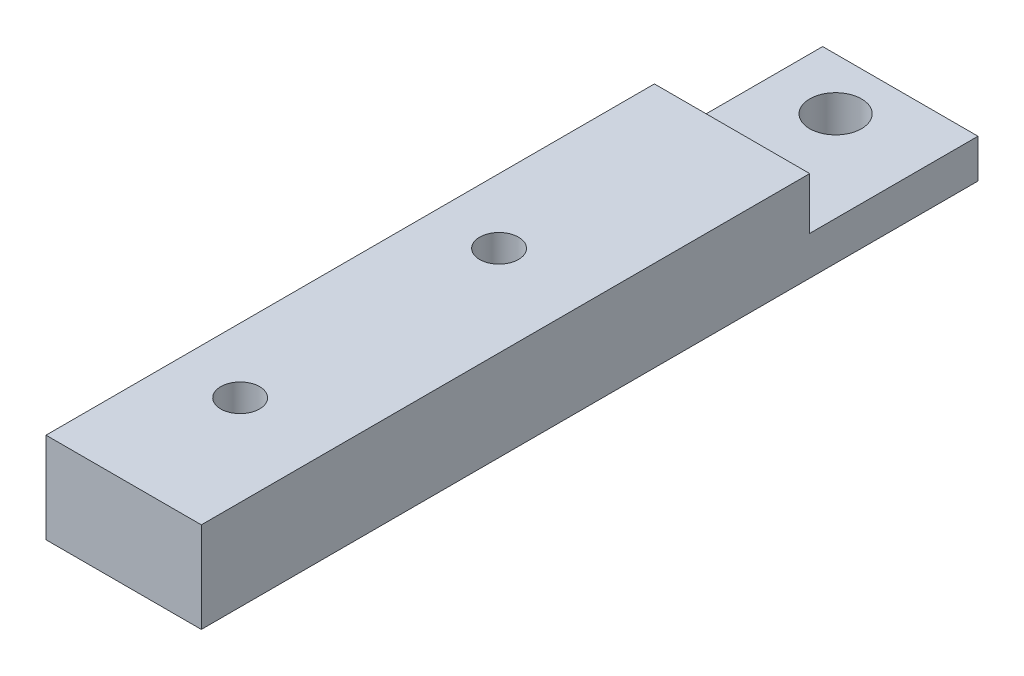
ISO-10303-21;
HEADER;
FILE_DESCRIPTION(('STEP AP214'),'2;1');
FILE_NAME('part.step','',(''),(''),'','','');
FILE_SCHEMA(('AUTOMOTIVE_DESIGN { 1 0 10303 214 1 1 1 1 }'));
ENDSEC;
DATA;
#1=APPLICATION_CONTEXT('core data for automotive mechanical design processes');
#2=APPLICATION_PROTOCOL_DEFINITION('international standard','automotive_design',2000,#1);
#3=PRODUCT_CONTEXT('',#1,'mechanical');
#4=PRODUCT('Part','Part','',(#3));
#5=PRODUCT_RELATED_PRODUCT_CATEGORY('part','',(#4));
#6=PRODUCT_DEFINITION_FORMATION('','',#4);
#7=PRODUCT_DEFINITION_CONTEXT('part definition',#1,'design');
#8=PRODUCT_DEFINITION('design','',#6,#7);
#9=PRODUCT_DEFINITION_SHAPE('','',#8);
#10=(LENGTH_UNIT() NAMED_UNIT(*) SI_UNIT(.MILLI.,.METRE.));
#11=(NAMED_UNIT(*) PLANE_ANGLE_UNIT() SI_UNIT($,.RADIAN.));
#12=(NAMED_UNIT(*) SI_UNIT($,.STERADIAN.) SOLID_ANGLE_UNIT());
#13=UNCERTAINTY_MEASURE_WITH_UNIT(LENGTH_MEASURE(1.E-05),#10,'distance_accuracy_value','');
#14=(GEOMETRIC_REPRESENTATION_CONTEXT(3) GLOBAL_UNCERTAINTY_ASSIGNED_CONTEXT((#13)) GLOBAL_UNIT_ASSIGNED_CONTEXT((#10,
#11,#12)) REPRESENTATION_CONTEXT('',''));
#15=CARTESIAN_POINT('',(0.,0.,0.));
#16=DIRECTION('',(0.,0.,1.));
#17=DIRECTION('',(1.,0.,0.));
#18=AXIS2_PLACEMENT_3D('',#15,#16,#17);
#19=CARTESIAN_POINT('',(-5.,7.,-30.));
#20=DIRECTION('',(0.,0.,1.));
#21=DIRECTION('',(1.,0.,0.));
#22=AXIS2_PLACEMENT_3D('',#19,#20,#21);
#23=PLANE('',#22);
#24=DIRECTION('',(0.,-1.,0.));
#25=VECTOR('',#24,1.);
#26=CARTESIAN_POINT('',(-5.,7.,-30.));
#27=LINE('',#26,#25);
#28=CARTESIAN_POINT('',(-5.,3.,-30.));
#29=VERTEX_POINT('',#28);
#30=CARTESIAN_POINT('',(-5.,0.,-30.));
#31=VERTEX_POINT('',#30);
#32=EDGE_CURVE('E11',#29,#31,#27,.T.);
#33=ORIENTED_EDGE('',*,*,#32,.F.);
#34=DIRECTION('',(-1.,0.,0.));
#35=VECTOR('',#34,1.);
#36=CARTESIAN_POINT('',(-5.,3.,-30.));
#37=LINE('',#36,#35);
#38=CARTESIAN_POINT('',(7.,3.,-30.));
#39=VERTEX_POINT('',#38);
#40=EDGE_CURVE('E75',#39,#29,#37,.T.);
#41=ORIENTED_EDGE('',*,*,#40,.F.);
#42=DIRECTION('',(0.,1.,0.));
#43=VECTOR('',#42,1.);
#44=CARTESIAN_POINT('',(7.,0.,-30.));
#45=LINE('',#44,#43);
#46=CARTESIAN_POINT('',(7.,0.,-30.));
#47=VERTEX_POINT('',#46);
#48=EDGE_CURVE('E117',#47,#39,#45,.T.);
#49=ORIENTED_EDGE('',*,*,#48,.F.);
#50=DIRECTION('',(-1.,0.,0.));
#51=VECTOR('',#50,1.);
#52=CARTESIAN_POINT('',(-5.,0.,-30.));
#53=LINE('',#52,#51);
#54=EDGE_CURVE('E148',#47,#31,#53,.T.);
#55=ORIENTED_EDGE('',*,*,#54,.T.);
#56=EDGE_LOOP('',(#33,#41,#49,#55));
#57=FACE_BOUND('',#56,.T.);
#58=ADVANCED_FACE('F32',(#57),#23,.F.);
#59=CARTESIAN_POINT('',(-5.,7.,-30.));
#60=DIRECTION('',(1.,0.,0.));
#61=DIRECTION('',(0.,0.,-1.));
#62=AXIS2_PLACEMENT_3D('',#59,#60,#61);
#63=PLANE('',#62);
#64=DIRECTION('',(0.,0.,1.));
#65=VECTOR('',#64,1.);
#66=CARTESIAN_POINT('',(-5.,7.,-30.));
#67=LINE('',#66,#65);
#68=CARTESIAN_POINT('',(-5.,7.,-17.));
#69=VERTEX_POINT('',#68);
#70=CARTESIAN_POINT('',(-5.,7.,30.));
#71=VERTEX_POINT('',#70);
#72=EDGE_CURVE('E54',#69,#71,#67,.T.);
#73=ORIENTED_EDGE('',*,*,#72,.F.);
#74=DIRECTION('',(0.,1.,0.));
#75=VECTOR('',#74,1.);
#76=CARTESIAN_POINT('',(-5.,3.,-17.));
#77=LINE('',#76,#75);
#78=CARTESIAN_POINT('',(-5.,3.,-17.));
#79=VERTEX_POINT('',#78);
#80=EDGE_CURVE('E46',#79,#69,#77,.T.);
#81=ORIENTED_EDGE('',*,*,#80,.F.);
#82=DIRECTION('',(0.,0.,1.));
#83=VECTOR('',#82,1.);
#84=CARTESIAN_POINT('',(-5.,3.,-17.));
#85=LINE('',#84,#83);
#86=EDGE_CURVE('E71',#29,#79,#85,.T.);
#87=ORIENTED_EDGE('',*,*,#86,.F.);
#88=ORIENTED_EDGE('',*,*,#32,.T.);
#89=DIRECTION('',(0.,0.,1.));
#90=VECTOR('',#89,1.);
#91=CARTESIAN_POINT('',(-5.,0.,-30.));
#92=LINE('',#91,#90);
#93=CARTESIAN_POINT('',(-5.,0.,30.));
#94=VERTEX_POINT('',#93);
#95=EDGE_CURVE('E151',#31,#94,#92,.T.);
#96=ORIENTED_EDGE('',*,*,#95,.T.);
#97=DIRECTION('',(0.,-1.,0.));
#98=VECTOR('',#97,1.);
#99=CARTESIAN_POINT('',(-5.,7.,30.));
#100=LINE('',#99,#98);
#101=EDGE_CURVE('E39',#71,#94,#100,.T.);
#102=ORIENTED_EDGE('',*,*,#101,.F.);
#103=EDGE_LOOP('',(#73,#81,#87,#88,#96,#102));
#104=FACE_BOUND('',#103,.T.);
#105=ADVANCED_FACE('F159',(#104),#63,.F.);
#106=CARTESIAN_POINT('',(-5.,7.,30.));
#107=DIRECTION('',(0.,0.,-1.));
#108=DIRECTION('',(-1.,0.,0.));
#109=AXIS2_PLACEMENT_3D('',#106,#107,#108);
#110=PLANE('',#109);
#111=DIRECTION('',(1.,0.,0.));
#112=VECTOR('',#111,1.);
#113=CARTESIAN_POINT('',(-5.,0.,30.));
#114=LINE('',#113,#112);
#115=CARTESIAN_POINT('',(7.,0.,30.));
#116=VERTEX_POINT('',#115);
#117=EDGE_CURVE('E103',#94,#116,#114,.T.);
#118=ORIENTED_EDGE('',*,*,#117,.T.);
#119=DIRECTION('',(0.,-1.,0.));
#120=VECTOR('',#119,1.);
#121=CARTESIAN_POINT('',(7.,7.,30.));
#122=LINE('',#121,#120);
#123=CARTESIAN_POINT('',(7.,7.,30.));
#124=VERTEX_POINT('',#123);
#125=EDGE_CURVE('E100',#124,#116,#122,.T.);
#126=ORIENTED_EDGE('',*,*,#125,.F.);
#127=DIRECTION('',(1.,0.,0.));
#128=VECTOR('',#127,1.);
#129=CARTESIAN_POINT('',(-5.,7.,30.));
#130=LINE('',#129,#128);
#131=EDGE_CURVE('E91',#71,#124,#130,.T.);
#132=ORIENTED_EDGE('',*,*,#131,.F.);
#133=ORIENTED_EDGE('',*,*,#101,.T.);
#134=EDGE_LOOP('',(#118,#126,#132,#133));
#135=FACE_BOUND('',#134,.T.);
#136=ADVANCED_FACE('F101',(#135),#110,.F.);
#137=CARTESIAN_POINT('',(0.,7.,0.));
#138=DIRECTION('',(0.,1.,0.));
#139=DIRECTION('',(0.,0.,1.));
#140=AXIS2_PLACEMENT_3D('',#137,#138,#139);
#141=PLANE('',#140);
#142=CARTESIAN_POINT('',(0.,7.,0.));
#143=DIRECTION('',(0.,1.,0.));
#144=DIRECTION('',(0.,0.,1.));
#145=AXIS2_PLACEMENT_3D('',#142,#143,#144);
#146=CIRCLE('',#145,1.5);
#147=CARTESIAN_POINT('',(0.,7.,1.5));
#148=VERTEX_POINT('',#147);
#149=EDGE_CURVE('E132',#148,#148,#146,.F.);
#150=ORIENTED_EDGE('',*,*,#149,.T.);
#151=EDGE_LOOP('',(#150));
#152=FACE_BOUND('',#151,.T.);
#153=CARTESIAN_POINT('',(0.,7.,20.));
#154=DIRECTION('',(0.,1.,0.));
#155=DIRECTION('',(0.,0.,1.));
#156=AXIS2_PLACEMENT_3D('',#153,#154,#155);
#157=CIRCLE('',#156,1.5);
#158=CARTESIAN_POINT('',(0.,7.,21.5));
#159=VERTEX_POINT('',#158);
#160=EDGE_CURVE('E127',#159,#159,#157,.F.);
#161=ORIENTED_EDGE('',*,*,#160,.T.);
#162=EDGE_LOOP('',(#161));
#163=FACE_BOUND('',#162,.T.);
#164=DIRECTION('',(1.,0.,0.));
#165=VECTOR('',#164,1.);
#166=CARTESIAN_POINT('',(-5.,7.,-17.));
#167=LINE('',#166,#165);
#168=CARTESIAN_POINT('',(7.,7.,-17.));
#169=VERTEX_POINT('',#168);
#170=EDGE_CURVE('E141',#69,#169,#167,.T.);
#171=ORIENTED_EDGE('',*,*,#170,.F.);
#172=ORIENTED_EDGE('',*,*,#72,.T.);
#173=ORIENTED_EDGE('',*,*,#131,.T.);
#174=DIRECTION('',(0.,0.,1.));
#175=VECTOR('',#174,1.);
#176=CARTESIAN_POINT('',(7.,7.,-17.));
#177=LINE('',#176,#175);
#178=EDGE_CURVE('E95',#169,#124,#177,.T.);
#179=ORIENTED_EDGE('',*,*,#178,.F.);
#180=EDGE_LOOP('',(#171,#172,#173,#179));
#181=FACE_BOUND('',#180,.T.);
#182=ADVANCED_FACE('F93',(#152,#163,#181),#141,.T.);
#183=CARTESIAN_POINT('',(0.,0.,0.));
#184=DIRECTION('',(0.,1.,0.));
#185=DIRECTION('',(0.,0.,1.));
#186=AXIS2_PLACEMENT_3D('',#183,#184,#185);
#187=PLANE('',#186);
#188=CARTESIAN_POINT('',(0.,0.,0.));
#189=DIRECTION('',(0.,1.,0.));
#190=DIRECTION('',(0.,0.,1.));
#191=AXIS2_PLACEMENT_3D('',#188,#189,#190);
#192=CIRCLE('',#191,1.5);
#193=CARTESIAN_POINT('',(0.,0.,1.5));
#194=VERTEX_POINT('',#193);
#195=EDGE_CURVE('E124',#194,#194,#192,.T.);
#196=ORIENTED_EDGE('',*,*,#195,.T.);
#197=EDGE_LOOP('',(#196));
#198=FACE_BOUND('',#197,.T.);
#199=CARTESIAN_POINT('',(0.,0.,20.));
#200=DIRECTION('',(0.,1.,0.));
#201=DIRECTION('',(0.,0.,1.));
#202=AXIS2_PLACEMENT_3D('',#199,#200,#201);
#203=CIRCLE('',#202,1.5);
#204=CARTESIAN_POINT('',(0.,0.,21.5));
#205=VERTEX_POINT('',#204);
#206=EDGE_CURVE('E123',#205,#205,#203,.T.);
#207=ORIENTED_EDGE('',*,*,#206,.T.);
#208=EDGE_LOOP('',(#207));
#209=FACE_BOUND('',#208,.T.);
#210=CARTESIAN_POINT('',(0.,0.,-26.));
#211=DIRECTION('',(0.,1.,0.));
#212=DIRECTION('',(0.,0.,1.));
#213=AXIS2_PLACEMENT_3D('',#210,#211,#212);
#214=CIRCLE('',#213,2.);
#215=CARTESIAN_POINT('',(0.,0.,-24.));
#216=VERTEX_POINT('',#215);
#217=EDGE_CURVE('E138',#216,#216,#214,.T.);
#218=ORIENTED_EDGE('',*,*,#217,.T.);
#219=EDGE_LOOP('',(#218));
#220=FACE_BOUND('',#219,.T.);
#221=ORIENTED_EDGE('',*,*,#54,.F.);
#222=DIRECTION('',(0.,0.,-1.));
#223=VECTOR('',#222,1.);
#224=CARTESIAN_POINT('',(7.,0.,30.));
#225=LINE('',#224,#223);
#226=EDGE_CURVE('E107',#116,#47,#225,.T.);
#227=ORIENTED_EDGE('',*,*,#226,.F.);
#228=ORIENTED_EDGE('',*,*,#117,.F.);
#229=ORIENTED_EDGE('',*,*,#95,.F.);
#230=EDGE_LOOP('',(#221,#227,#228,#229));
#231=FACE_BOUND('',#230,.T.);
#232=ADVANCED_FACE('F155',(#198,#209,#220,#231),#187,.F.);
#233=CARTESIAN_POINT('',(-5.,3.,-17.));
#234=DIRECTION('',(0.,0.,1.));
#235=DIRECTION('',(1.,0.,0.));
#236=AXIS2_PLACEMENT_3D('',#233,#234,#235);
#237=PLANE('',#236);
#238=ORIENTED_EDGE('',*,*,#170,.T.);
#239=DIRECTION('',(0.,1.,0.));
#240=VECTOR('',#239,1.);
#241=CARTESIAN_POINT('',(7.,3.,-17.));
#242=LINE('',#241,#240);
#243=CARTESIAN_POINT('',(7.,3.,-17.));
#244=VERTEX_POINT('',#243);
#245=EDGE_CURVE('E113',#244,#169,#242,.T.);
#246=ORIENTED_EDGE('',*,*,#245,.F.);
#247=DIRECTION('',(1.,0.,0.));
#248=VECTOR('',#247,1.);
#249=CARTESIAN_POINT('',(-5.,3.,-17.));
#250=LINE('',#249,#248);
#251=EDGE_CURVE('E144',#79,#244,#250,.T.);
#252=ORIENTED_EDGE('',*,*,#251,.F.);
#253=ORIENTED_EDGE('',*,*,#80,.T.);
#254=EDGE_LOOP('',(#238,#246,#252,#253));
#255=FACE_BOUND('',#254,.T.);
#256=ADVANCED_FACE('F170',(#255),#237,.F.);
#257=CARTESIAN_POINT('',(0.,3.,0.));
#258=DIRECTION('',(0.,-1.,0.));
#259=DIRECTION('',(0.,0.,-1.));
#260=AXIS2_PLACEMENT_3D('',#257,#258,#259);
#261=PLANE('',#260);
#262=CARTESIAN_POINT('',(0.,3.,-26.));
#263=DIRECTION('',(0.,1.,0.));
#264=DIRECTION('',(0.,0.,1.));
#265=AXIS2_PLACEMENT_3D('',#262,#263,#264);
#266=CIRCLE('',#265,2.);
#267=CARTESIAN_POINT('',(0.,3.,-24.));
#268=VERTEX_POINT('',#267);
#269=EDGE_CURVE('E135',#268,#268,#266,.T.);
#270=ORIENTED_EDGE('',*,*,#269,.F.);
#271=EDGE_LOOP('',(#270));
#272=FACE_BOUND('',#271,.T.);
#273=ORIENTED_EDGE('',*,*,#251,.T.);
#274=DIRECTION('',(0.,0.,1.));
#275=VECTOR('',#274,1.);
#276=CARTESIAN_POINT('',(7.,3.,-30.));
#277=LINE('',#276,#275);
#278=EDGE_CURVE('E120',#39,#244,#277,.T.);
#279=ORIENTED_EDGE('',*,*,#278,.F.);
#280=ORIENTED_EDGE('',*,*,#40,.T.);
#281=ORIENTED_EDGE('',*,*,#86,.T.);
#282=EDGE_LOOP('',(#273,#279,#280,#281));
#283=FACE_BOUND('',#282,.T.);
#284=ADVANCED_FACE('F177',(#272,#283),#261,.F.);
#285=CARTESIAN_POINT('',(0.,-1.,-26.));
#286=DIRECTION('',(0.,1.,0.));
#287=DIRECTION('',(0.,0.,1.));
#288=AXIS2_PLACEMENT_3D('',#285,#286,#287);
#289=CYLINDRICAL_SURFACE('',#288,2.);
#290=ORIENTED_EDGE('',*,*,#269,.T.);
#291=EDGE_LOOP('',(#290));
#292=FACE_BOUND('',#291,.T.);
#293=ORIENTED_EDGE('',*,*,#217,.F.);
#294=EDGE_LOOP('',(#293));
#295=FACE_BOUND('',#294,.T.);
#296=ADVANCED_FACE('F180',(#292,#295),#289,.F.);
#297=CARTESIAN_POINT('',(0.,14.,20.));
#298=DIRECTION('',(0.,-1.,0.));
#299=DIRECTION('',(0.,0.,-1.));
#300=AXIS2_PLACEMENT_3D('',#297,#298,#299);
#301=CYLINDRICAL_SURFACE('',#300,1.5);
#302=ORIENTED_EDGE('',*,*,#160,.F.);
#303=EDGE_LOOP('',(#302));
#304=FACE_BOUND('',#303,.T.);
#305=ORIENTED_EDGE('',*,*,#206,.F.);
#306=EDGE_LOOP('',(#305));
#307=FACE_BOUND('',#306,.T.);
#308=ADVANCED_FACE('F184',(#304,#307),#301,.F.);
#309=CARTESIAN_POINT('',(0.,14.,0.));
#310=DIRECTION('',(0.,-1.,0.));
#311=DIRECTION('',(0.,0.,-1.));
#312=AXIS2_PLACEMENT_3D('',#309,#310,#311);
#313=CYLINDRICAL_SURFACE('',#312,1.5);
#314=ORIENTED_EDGE('',*,*,#149,.F.);
#315=EDGE_LOOP('',(#314));
#316=FACE_BOUND('',#315,.T.);
#317=ORIENTED_EDGE('',*,*,#195,.F.);
#318=EDGE_LOOP('',(#317));
#319=FACE_BOUND('',#318,.T.);
#320=ADVANCED_FACE('F188',(#316,#319),#313,.F.);
#321=CARTESIAN_POINT('',(7.,0.,0.));
#322=DIRECTION('',(1.,0.,0.));
#323=DIRECTION('',(0.,0.,-1.));
#324=AXIS2_PLACEMENT_3D('',#321,#322,#323);
#325=PLANE('',#324);
#326=ORIENTED_EDGE('',*,*,#178,.T.);
#327=ORIENTED_EDGE('',*,*,#125,.T.);
#328=ORIENTED_EDGE('',*,*,#226,.T.);
#329=ORIENTED_EDGE('',*,*,#48,.T.);
#330=ORIENTED_EDGE('',*,*,#278,.T.);
#331=ORIENTED_EDGE('',*,*,#245,.T.);
#332=EDGE_LOOP('',(#326,#327,#328,#329,#330,#331));
#333=FACE_BOUND('',#332,.T.);
#334=ADVANCED_FACE('F110',(#333),#325,.T.);
#335=CLOSED_SHELL('',(#58,#105,#136,#182,#232,#256,#284,#296,#308,#320,#334));
#336=MANIFOLD_SOLID_BREP('B2',#335);
#337=ADVANCED_BREP_SHAPE_REPRESENTATION('',(#18,#336),#14);
#338=SHAPE_DEFINITION_REPRESENTATION(#9,#337);
ENDSEC;
END-ISO-10303-21;
